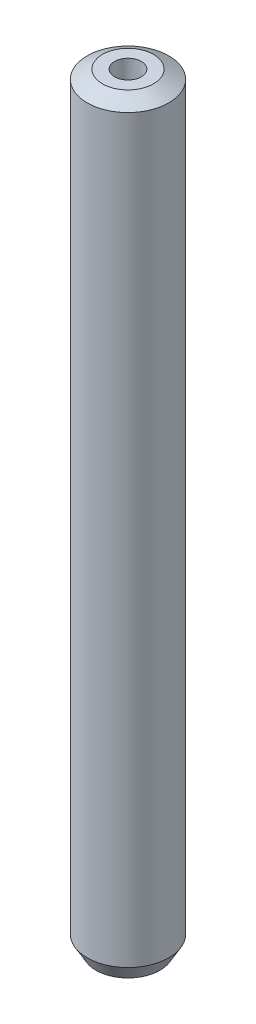
ISO-10303-21;
HEADER;
FILE_DESCRIPTION(('STEP AP214'),'2;1');
FILE_NAME('part.step','',(''),(''),'','','');
FILE_SCHEMA(('AUTOMOTIVE_DESIGN { 1 0 10303 214 1 1 1 1 }'));
ENDSEC;
DATA;
#1=APPLICATION_CONTEXT('core data for automotive mechanical design processes');
#2=APPLICATION_PROTOCOL_DEFINITION('international standard','automotive_design',2000,#1);
#3=PRODUCT_CONTEXT('',#1,'mechanical');
#4=PRODUCT('Part','Part','',(#3));
#5=PRODUCT_RELATED_PRODUCT_CATEGORY('part','',(#4));
#6=PRODUCT_DEFINITION_FORMATION('','',#4);
#7=PRODUCT_DEFINITION_CONTEXT('part definition',#1,'design');
#8=PRODUCT_DEFINITION('design','',#6,#7);
#9=PRODUCT_DEFINITION_SHAPE('','',#8);
#10=(LENGTH_UNIT() NAMED_UNIT(*) SI_UNIT(.MILLI.,.METRE.));
#11=(NAMED_UNIT(*) PLANE_ANGLE_UNIT() SI_UNIT($,.RADIAN.));
#12=(NAMED_UNIT(*) SI_UNIT($,.STERADIAN.) SOLID_ANGLE_UNIT());
#13=UNCERTAINTY_MEASURE_WITH_UNIT(LENGTH_MEASURE(1.E-05),#10,'distance_accuracy_value','');
#14=(GEOMETRIC_REPRESENTATION_CONTEXT(3) GLOBAL_UNCERTAINTY_ASSIGNED_CONTEXT((#13)) GLOBAL_UNIT_ASSIGNED_CONTEXT((#10,
#11,#12)) REPRESENTATION_CONTEXT('',''));
#15=CARTESIAN_POINT('',(0.,0.,0.));
#16=DIRECTION('',(0.,0.,1.));
#17=DIRECTION('',(1.,0.,0.));
#18=AXIS2_PLACEMENT_3D('',#15,#16,#17);
#19=CARTESIAN_POINT('',(0.,468.509761188843,0.));
#20=DIRECTION('',(0.,-1.,0.));
#21=DIRECTION('',(0.,0.,-1.));
#22=AXIS2_PLACEMENT_3D('',#19,#20,#21);
#23=CYLINDRICAL_SURFACE('',#22,25.);
#24=CARTESIAN_POINT('',(0.,463.10549385164,0.));
#25=DIRECTION('',(0.,1.,0.));
#26=DIRECTION('',(0.,0.,1.));
#27=AXIS2_PLACEMENT_3D('',#24,#25,#26);
#28=CIRCLE('',#27,25.);
#29=CARTESIAN_POINT('',(0.,463.10549385164,25.));
#30=VERTEX_POINT('',#29);
#31=EDGE_CURVE('E50',#30,#30,#28,.F.);
#32=ORIENTED_EDGE('',*,*,#31,.T.);
#33=EDGE_LOOP('',(#32));
#34=FACE_BOUND('',#33,.T.);
#35=CARTESIAN_POINT('',(0.,9.36046560571957,0.));
#36=DIRECTION('',(0.,1.,0.));
#37=DIRECTION('',(0.,0.,1.));
#38=AXIS2_PLACEMENT_3D('',#35,#36,#37);
#39=CIRCLE('',#38,25.);
#40=CARTESIAN_POINT('',(0.,9.36046560571957,25.));
#41=VERTEX_POINT('',#40);
#42=EDGE_CURVE('E51',#41,#41,#39,.T.);
#43=ORIENTED_EDGE('',*,*,#42,.T.);
#44=EDGE_LOOP('',(#43));
#45=FACE_BOUND('',#44,.T.);
#46=ADVANCED_FACE('F39',(#34,#45),#23,.T.);
#47=CARTESIAN_POINT('',(0.,468.509761188843,0.));
#48=DIRECTION('',(0.,1.,0.));
#49=DIRECTION('',(0.,0.,1.));
#50=AXIS2_PLACEMENT_3D('',#47,#48,#49);
#51=PLANE('',#50);
#52=CARTESIAN_POINT('',(0.,468.509761188843,0.));
#53=DIRECTION('',(0.,1.,0.));
#54=DIRECTION('',(0.,0.,1.));
#55=AXIS2_PLACEMENT_3D('',#52,#53,#54);
#56=CIRCLE('',#55,15.6395343942804);
#57=CARTESIAN_POINT('',(0.,468.509761188843,15.6395343942804));
#58=VERTEX_POINT('',#57);
#59=EDGE_CURVE('E54',#58,#58,#56,.T.);
#60=ORIENTED_EDGE('',*,*,#59,.T.);
#61=EDGE_LOOP('',(#60));
#62=FACE_BOUND('',#61,.T.);
#63=CARTESIAN_POINT('',(0.,468.509761188843,0.));
#64=DIRECTION('',(0.,1.,0.));
#65=DIRECTION('',(0.,0.,1.));
#66=AXIS2_PLACEMENT_3D('',#63,#64,#65);
#67=CIRCLE('',#66,8.18376760934162);
#68=CARTESIAN_POINT('',(0.,468.509761188843,8.18376760934162));
#69=VERTEX_POINT('',#68);
#70=EDGE_CURVE('E58',#69,#69,#67,.T.);
#71=ORIENTED_EDGE('',*,*,#70,.F.);
#72=EDGE_LOOP('',(#71));
#73=FACE_BOUND('',#72,.T.);
#74=ADVANCED_FACE('F69',(#62,#73),#51,.T.);
#75=CARTESIAN_POINT('',(0.,0.,0.));
#76=DIRECTION('',(0.,1.,0.));
#77=DIRECTION('',(0.,0.,1.));
#78=AXIS2_PLACEMENT_3D('',#75,#76,#77);
#79=PLANE('',#78);
#80=CARTESIAN_POINT('',(0.,0.,0.));
#81=DIRECTION('',(0.,1.,0.));
#82=DIRECTION('',(0.,0.,1.));
#83=AXIS2_PLACEMENT_3D('',#80,#81,#82);
#84=CIRCLE('',#83,19.5957326627975);
#85=CARTESIAN_POINT('',(0.,0.,19.5957326627975));
#86=VERTEX_POINT('',#85);
#87=EDGE_CURVE('E10',#86,#86,#84,.F.);
#88=ORIENTED_EDGE('',*,*,#87,.T.);
#89=EDGE_LOOP('',(#88));
#90=FACE_BOUND('',#89,.T.);
#91=CARTESIAN_POINT('',(0.,0.,0.));
#92=DIRECTION('',(0.,1.,0.));
#93=DIRECTION('',(0.,0.,1.));
#94=AXIS2_PLACEMENT_3D('',#91,#92,#93);
#95=CIRCLE('',#94,8.18376760934162);
#96=CARTESIAN_POINT('',(0.,0.,8.18376760934162));
#97=VERTEX_POINT('',#96);
#98=EDGE_CURVE('E63',#97,#97,#95,.T.);
#99=ORIENTED_EDGE('',*,*,#98,.T.);
#100=EDGE_LOOP('',(#99));
#101=FACE_BOUND('',#100,.T.);
#102=ADVANCED_FACE('F75',(#90,#101),#79,.F.);
#103=CARTESIAN_POINT('',(0.,468.509761188843,0.));
#104=DIRECTION('',(0.,-1.,0.));
#105=DIRECTION('',(0.,0.,-1.));
#106=AXIS2_PLACEMENT_3D('',#103,#104,#105);
#107=CYLINDRICAL_SURFACE('',#106,8.18376760934162);
#108=ORIENTED_EDGE('',*,*,#70,.T.);
#109=EDGE_LOOP('',(#108));
#110=FACE_BOUND('',#109,.T.);
#111=ORIENTED_EDGE('',*,*,#98,.F.);
#112=EDGE_LOOP('',(#111));
#113=FACE_BOUND('',#112,.T.);
#114=ADVANCED_FACE('F70',(#110,#113),#107,.F.);
#115=CARTESIAN_POINT('',(0.,468.509761188843,0.));
#116=DIRECTION('',(0.,-1.,0.));
#117=DIRECTION('',(0.,0.,-1.));
#118=AXIS2_PLACEMENT_3D('',#115,#116,#117);
#119=CONICAL_SURFACE('',#118,15.6395343942804,1.0471975511966);
#120=ORIENTED_EDGE('',*,*,#31,.F.);
#121=EDGE_LOOP('',(#120));
#122=FACE_BOUND('',#121,.T.);
#123=ORIENTED_EDGE('',*,*,#59,.F.);
#124=EDGE_LOOP('',(#123));
#125=FACE_BOUND('',#124,.T.);
#126=ADVANCED_FACE('F81',(#122,#125),#119,.T.);
#127=CARTESIAN_POINT('',(0.,9.36046560571957,0.));
#128=DIRECTION('',(0.,1.,0.));
#129=DIRECTION('',(0.,0.,1.));
#130=AXIS2_PLACEMENT_3D('',#127,#128,#129);
#131=CONICAL_SURFACE('',#130,25.,0.523598775598303);
#132=ORIENTED_EDGE('',*,*,#87,.F.);
#133=EDGE_LOOP('',(#132));
#134=FACE_BOUND('',#133,.T.);
#135=ORIENTED_EDGE('',*,*,#42,.F.);
#136=EDGE_LOOP('',(#135));
#137=FACE_BOUND('',#136,.T.);
#138=ADVANCED_FACE('F45',(#134,#137),#131,.T.);
#139=CLOSED_SHELL('',(#46,#74,#102,#114,#126,#138));
#140=MANIFOLD_SOLID_BREP('B2',#139);
#141=ADVANCED_BREP_SHAPE_REPRESENTATION('',(#18,#140),#14);
#142=SHAPE_DEFINITION_REPRESENTATION(#9,#141);
ENDSEC;
END-ISO-10303-21;
